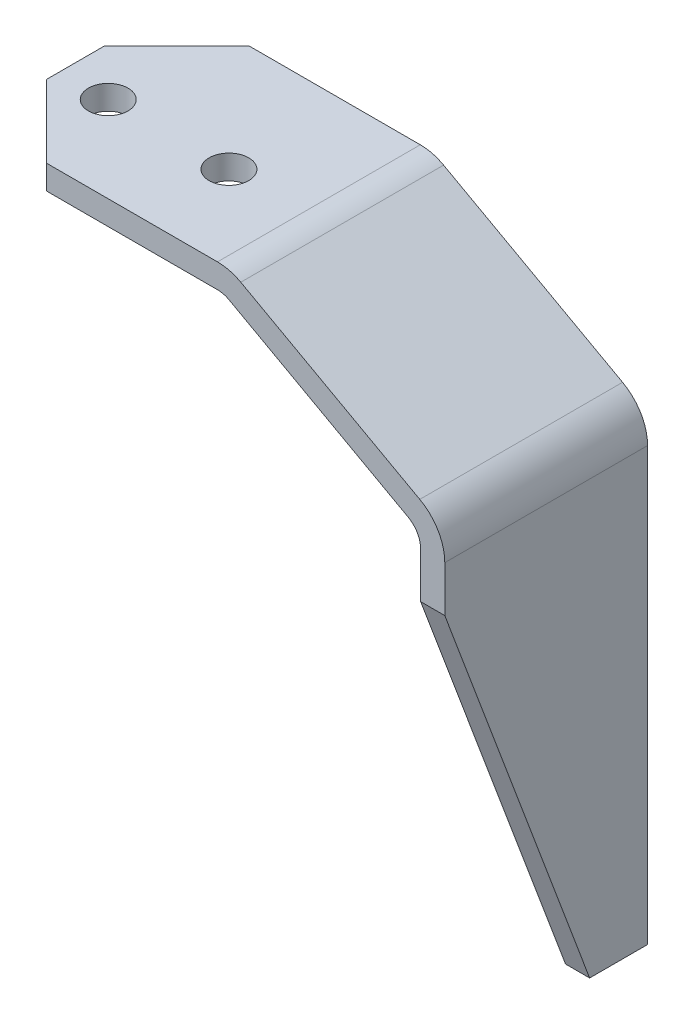
ISO-10303-21;
HEADER;
FILE_DESCRIPTION(('STEP AP214'),'2;1');
FILE_NAME('part.step','',(''),(''),'','','');
FILE_SCHEMA(('AUTOMOTIVE_DESIGN { 1 0 10303 214 1 1 1 1 }'));
ENDSEC;
DATA;
#1=APPLICATION_CONTEXT('core data for automotive mechanical design processes');
#2=APPLICATION_PROTOCOL_DEFINITION('international standard','automotive_design',2000,#1);
#3=PRODUCT_CONTEXT('',#1,'mechanical');
#4=PRODUCT('Part','Part','',(#3));
#5=PRODUCT_RELATED_PRODUCT_CATEGORY('part','',(#4));
#6=PRODUCT_DEFINITION_FORMATION('','',#4);
#7=PRODUCT_DEFINITION_CONTEXT('part definition',#1,'design');
#8=PRODUCT_DEFINITION('design','',#6,#7);
#9=PRODUCT_DEFINITION_SHAPE('','',#8);
#10=(LENGTH_UNIT() NAMED_UNIT(*) SI_UNIT(.MILLI.,.METRE.));
#11=(NAMED_UNIT(*) PLANE_ANGLE_UNIT() SI_UNIT($,.RADIAN.));
#12=(NAMED_UNIT(*) SI_UNIT($,.STERADIAN.) SOLID_ANGLE_UNIT());
#13=UNCERTAINTY_MEASURE_WITH_UNIT(LENGTH_MEASURE(1.E-05),#10,'distance_accuracy_value','');
#14=(GEOMETRIC_REPRESENTATION_CONTEXT(3) GLOBAL_UNCERTAINTY_ASSIGNED_CONTEXT((#13)) GLOBAL_UNIT_ASSIGNED_CONTEXT((#10,
#11,#12)) REPRESENTATION_CONTEXT('',''));
#15=CARTESIAN_POINT('',(0.,0.,0.));
#16=DIRECTION('',(0.,0.,1.));
#17=DIRECTION('',(1.,0.,0.));
#18=AXIS2_PLACEMENT_3D('',#15,#16,#17);
#19=CARTESIAN_POINT('',(-0.921587822254805,317.701582512491,-42.));
#20=DIRECTION('',(0.,0.,1.));
#21=DIRECTION('',(1.,0.,0.));
#22=AXIS2_PLACEMENT_3D('',#19,#20,#21);
#23=CYLINDRICAL_SURFACE('',#22,5.);
#24=CARTESIAN_POINT('',(-0.921587822254805,317.701582512491,0.));
#25=DIRECTION('',(0.,0.,-1.));
#26=DIRECTION('',(1.,0.,0.));
#27=AXIS2_PLACEMENT_3D('',#24,#25,#26);
#28=CIRCLE('',#27,5.);
#29=CARTESIAN_POINT('',(-0.921587822254821,322.701582512491,0.));
#30=VERTEX_POINT('',#29);
#31=CARTESIAN_POINT('',(1.48989491306705,322.081622582769,0.));
#32=VERTEX_POINT('',#31);
#33=EDGE_CURVE('E224',#30,#32,#28,.T.);
#34=ORIENTED_EDGE('',*,*,#33,.F.);
#35=DIRECTION('',(0.,0.,1.));
#36=VECTOR('',#35,1.);
#37=CARTESIAN_POINT('',(-0.921587822254821,322.701582512491,-42.));
#38=LINE('',#37,#36);
#39=CARTESIAN_POINT('',(-0.921587822254821,322.701582512491,-42.));
#40=VERTEX_POINT('',#39);
#41=EDGE_CURVE('E50',#40,#30,#38,.T.);
#42=ORIENTED_EDGE('',*,*,#41,.F.);
#43=CARTESIAN_POINT('',(-0.921587822254805,317.701582512491,-42.));
#44=DIRECTION('',(0.,0.,-1.));
#45=DIRECTION('',(1.,0.,0.));
#46=AXIS2_PLACEMENT_3D('',#43,#44,#45);
#47=CIRCLE('',#46,5.);
#48=CARTESIAN_POINT('',(1.48989491306705,322.081622582769,-42.));
#49=VERTEX_POINT('',#48);
#50=EDGE_CURVE('E260',#40,#49,#47,.T.);
#51=ORIENTED_EDGE('',*,*,#50,.T.);
#52=DIRECTION('',(0.,0.,1.));
#53=VECTOR('',#52,1.);
#54=CARTESIAN_POINT('',(1.48989491306705,322.081622582769,-42.));
#55=LINE('',#54,#53);
#56=EDGE_CURVE('E206',#49,#32,#55,.T.);
#57=ORIENTED_EDGE('',*,*,#56,.T.);
#58=EDGE_LOOP('',(#34,#42,#51,#57));
#59=FACE_BOUND('',#58,.T.);
#60=ADVANCED_FACE('F42',(#59),#23,.F.);
#61=CARTESIAN_POINT('',(-51.3507216881506,322.701582512491,-42.));
#62=DIRECTION('',(0.,-1.,0.));
#63=DIRECTION('',(0.,0.,-1.));
#64=AXIS2_PLACEMENT_3D('',#61,#62,#63);
#65=PLANE('',#64);
#66=DIRECTION('',(-0.707106781186547,0.,0.707106781186547));
#67=VECTOR('',#66,1.);
#68=CARTESIAN_POINT('',(-36.3507216881506,322.701582512491,-42.));
#69=LINE('',#68,#67);
#70=CARTESIAN_POINT('',(-36.3507216881506,322.701582512491,-42.));
#71=VERTEX_POINT('',#70);
#72=CARTESIAN_POINT('',(-51.3507216881506,322.701582512491,-27.));
#73=VERTEX_POINT('',#72);
#74=EDGE_CURVE('E150',#71,#73,#69,.T.);
#75=ORIENTED_EDGE('',*,*,#74,.F.);
#76=DIRECTION('',(1.,0.,0.));
#77=VECTOR('',#76,1.);
#78=CARTESIAN_POINT('',(-51.3507216881506,322.701582512491,-42.));
#79=LINE('',#78,#77);
#80=EDGE_CURVE('E208',#71,#40,#79,.T.);
#81=ORIENTED_EDGE('',*,*,#80,.T.);
#82=ORIENTED_EDGE('',*,*,#41,.T.);
#83=DIRECTION('',(1.,0.,0.));
#84=VECTOR('',#83,1.);
#85=CARTESIAN_POINT('',(-51.3507216881506,322.701582512491,0.));
#86=LINE('',#85,#84);
#87=CARTESIAN_POINT('',(-36.3507216881506,322.701582512491,0.));
#88=VERTEX_POINT('',#87);
#89=EDGE_CURVE('E259',#88,#30,#86,.T.);
#90=ORIENTED_EDGE('',*,*,#89,.F.);
#91=DIRECTION('',(0.707106781186547,0.,0.707106781186547));
#92=VECTOR('',#91,1.);
#93=CARTESIAN_POINT('',(-36.3507216881506,322.701582512491,0.));
#94=LINE('',#93,#92);
#95=CARTESIAN_POINT('',(-51.3507216881506,322.701582512491,-15.));
#96=VERTEX_POINT('',#95);
#97=EDGE_CURVE('E65',#96,#88,#94,.T.);
#98=ORIENTED_EDGE('',*,*,#97,.F.);
#99=DIRECTION('',(0.,0.,1.));
#100=VECTOR('',#99,1.);
#101=CARTESIAN_POINT('',(-51.3507216881506,322.701582512491,-42.));
#102=LINE('',#101,#100);
#103=EDGE_CURVE('E172',#73,#96,#102,.T.);
#104=ORIENTED_EDGE('',*,*,#103,.F.);
#105=EDGE_LOOP('',(#75,#81,#82,#90,#98,#104));
#106=FACE_BOUND('',#105,.T.);
#107=CARTESIAN_POINT('',(-16.3507216881506,322.701582512491,-17.8));
#108=DIRECTION('',(0.,-1.,0.));
#109=DIRECTION('',(0.,0.,-1.));
#110=AXIS2_PLACEMENT_3D('',#107,#108,#109);
#111=CIRCLE('',#110,4.1);
#112=CARTESIAN_POINT('',(-16.3507216881506,322.701582512491,-21.9));
#113=VERTEX_POINT('',#112);
#114=EDGE_CURVE('E272',#113,#113,#111,.T.);
#115=ORIENTED_EDGE('',*,*,#114,.F.);
#116=EDGE_LOOP('',(#115));
#117=FACE_BOUND('',#116,.T.);
#118=CARTESIAN_POINT('',(-41.3507216881506,322.701582512491,-17.8));
#119=DIRECTION('',(0.,-1.,0.));
#120=DIRECTION('',(0.,0.,-1.));
#121=AXIS2_PLACEMENT_3D('',#118,#119,#120);
#122=CIRCLE('',#121,4.1);
#123=CARTESIAN_POINT('',(-41.3507216881506,322.701582512491,-21.9));
#124=VERTEX_POINT('',#123);
#125=EDGE_CURVE('E287',#124,#124,#122,.T.);
#126=ORIENTED_EDGE('',*,*,#125,.F.);
#127=EDGE_LOOP('',(#126));
#128=FACE_BOUND('',#127,.T.);
#129=ADVANCED_FACE('F264',(#106,#117,#128),#65,.T.);
#130=CARTESIAN_POINT('',(-51.3507216881506,327.701582512491,-42.));
#131=DIRECTION('',(-1.,0.,0.));
#132=DIRECTION('',(0.,0.,1.));
#133=AXIS2_PLACEMENT_3D('',#130,#131,#132);
#134=PLANE('',#133);
#135=DIRECTION('',(0.,-1.,0.));
#136=VECTOR('',#135,1.);
#137=CARTESIAN_POINT('',(-51.3507216881506,327.701582512491,-27.));
#138=LINE('',#137,#136);
#139=CARTESIAN_POINT('',(-51.3507216881506,327.701582512491,-27.));
#140=VERTEX_POINT('',#139);
#141=EDGE_CURVE('E147',#140,#73,#138,.T.);
#142=ORIENTED_EDGE('',*,*,#141,.T.);
#143=ORIENTED_EDGE('',*,*,#103,.T.);
#144=DIRECTION('',(0.,-1.,0.));
#145=VECTOR('',#144,1.);
#146=CARTESIAN_POINT('',(-51.3507216881506,327.701582512491,-15.));
#147=LINE('',#146,#145);
#148=CARTESIAN_POINT('',(-51.3507216881506,327.701582512491,-15.));
#149=VERTEX_POINT('',#148);
#150=EDGE_CURVE('E170',#149,#96,#147,.T.);
#151=ORIENTED_EDGE('',*,*,#150,.F.);
#152=DIRECTION('',(0.,0.,1.));
#153=VECTOR('',#152,1.);
#154=CARTESIAN_POINT('',(-51.3507216881506,327.701582512491,-42.));
#155=LINE('',#154,#153);
#156=EDGE_CURVE('E162',#140,#149,#155,.T.);
#157=ORIENTED_EDGE('',*,*,#156,.F.);
#158=EDGE_LOOP('',(#142,#143,#151,#157));
#159=FACE_BOUND('',#158,.T.);
#160=ADVANCED_FACE('F169',(#159),#134,.T.);
#161=CARTESIAN_POINT('',(-51.3507216881506,327.701582512491,-42.));
#162=DIRECTION('',(0.,1.,0.));
#163=DIRECTION('',(0.,0.,1.));
#164=AXIS2_PLACEMENT_3D('',#161,#162,#163);
#165=PLANE('',#164);
#166=DIRECTION('',(-0.707106781186547,0.,0.707106781186547));
#167=VECTOR('',#166,1.);
#168=CARTESIAN_POINT('',(-36.3507216881506,327.701582512491,-42.));
#169=LINE('',#168,#167);
#170=CARTESIAN_POINT('',(-36.3507216881506,327.701582512491,-42.));
#171=VERTEX_POINT('',#170);
#172=EDGE_CURVE('E57',#171,#140,#169,.T.);
#173=ORIENTED_EDGE('',*,*,#172,.T.);
#174=ORIENTED_EDGE('',*,*,#156,.T.);
#175=DIRECTION('',(0.707106781186547,0.,0.707106781186547));
#176=VECTOR('',#175,1.);
#177=CARTESIAN_POINT('',(-36.3507216881506,327.701582512491,0.));
#178=LINE('',#177,#176);
#179=CARTESIAN_POINT('',(-36.3507216881506,327.701582512491,0.));
#180=VERTEX_POINT('',#179);
#181=EDGE_CURVE('E280',#149,#180,#178,.T.);
#182=ORIENTED_EDGE('',*,*,#181,.T.);
#183=DIRECTION('',(-1.,0.,0.));
#184=VECTOR('',#183,1.);
#185=CARTESIAN_POINT('',(-51.3507216881506,327.701582512491,0.));
#186=LINE('',#185,#184);
#187=CARTESIAN_POINT('',(-0.921587822254793,327.701582512491,0.));
#188=VERTEX_POINT('',#187);
#189=EDGE_CURVE('E255',#188,#180,#186,.T.);
#190=ORIENTED_EDGE('',*,*,#189,.F.);
#191=DIRECTION('',(0.,0.,1.));
#192=VECTOR('',#191,1.);
#193=CARTESIAN_POINT('',(-0.921587822254793,327.701582512491,-42.));
#194=LINE('',#193,#192);
#195=CARTESIAN_POINT('',(-0.921587822254793,327.701582512491,-42.));
#196=VERTEX_POINT('',#195);
#197=EDGE_CURVE('E173',#196,#188,#194,.T.);
#198=ORIENTED_EDGE('',*,*,#197,.F.);
#199=DIRECTION('',(-1.,0.,0.));
#200=VECTOR('',#199,1.);
#201=CARTESIAN_POINT('',(-51.3507216881506,327.701582512491,-42.));
#202=LINE('',#201,#200);
#203=EDGE_CURVE('E165',#196,#171,#202,.T.);
#204=ORIENTED_EDGE('',*,*,#203,.T.);
#205=EDGE_LOOP('',(#173,#174,#182,#190,#198,#204));
#206=FACE_BOUND('',#205,.T.);
#207=CARTESIAN_POINT('',(-16.3507216881506,327.701582512491,-17.8));
#208=DIRECTION('',(0.,-1.,0.));
#209=DIRECTION('',(0.,0.,-1.));
#210=AXIS2_PLACEMENT_3D('',#207,#208,#209);
#211=CIRCLE('',#210,4.1);
#212=CARTESIAN_POINT('',(-16.3507216881506,327.701582512491,-21.9));
#213=VERTEX_POINT('',#212);
#214=EDGE_CURVE('E278',#213,#213,#211,.T.);
#215=ORIENTED_EDGE('',*,*,#214,.T.);
#216=EDGE_LOOP('',(#215));
#217=FACE_BOUND('',#216,.T.);
#218=CARTESIAN_POINT('',(-41.3507216881506,327.701582512491,-17.8));
#219=DIRECTION('',(0.,-1.,0.));
#220=DIRECTION('',(0.,0.,-1.));
#221=AXIS2_PLACEMENT_3D('',#218,#219,#220);
#222=CIRCLE('',#221,4.1);
#223=CARTESIAN_POINT('',(-41.3507216881506,327.701582512491,-21.9));
#224=VERTEX_POINT('',#223);
#225=EDGE_CURVE('E289',#224,#224,#222,.T.);
#226=ORIENTED_EDGE('',*,*,#225,.T.);
#227=EDGE_LOOP('',(#226));
#228=FACE_BOUND('',#227,.T.);
#229=ADVANCED_FACE('F159',(#206,#217,#228),#165,.T.);
#230=CARTESIAN_POINT('',(-0.921587822254805,317.701582512491,-42.));
#231=DIRECTION('',(0.,0.,1.));
#232=DIRECTION('',(1.,0.,0.));
#233=AXIS2_PLACEMENT_3D('',#230,#231,#232);
#234=CYLINDRICAL_SURFACE('',#233,9.99999999999996);
#235=CARTESIAN_POINT('',(-0.921587822254805,317.701582512491,0.));
#236=DIRECTION('',(0.,0.,1.));
#237=DIRECTION('',(1.,0.,0.));
#238=AXIS2_PLACEMENT_3D('',#235,#236,#237);
#239=CIRCLE('',#238,9.99999999999996);
#240=CARTESIAN_POINT('',(3.90137764838883,326.461662653048,0.));
#241=VERTEX_POINT('',#240);
#242=EDGE_CURVE('E251',#241,#188,#239,.T.);
#243=ORIENTED_EDGE('',*,*,#242,.F.);
#244=DIRECTION('',(0.,0.,1.));
#245=VECTOR('',#244,1.);
#246=CARTESIAN_POINT('',(3.90137764838883,326.461662653048,-42.));
#247=LINE('',#246,#245);
#248=CARTESIAN_POINT('',(3.90137764838883,326.461662653048,-42.));
#249=VERTEX_POINT('',#248);
#250=EDGE_CURVE('E180',#249,#241,#247,.T.);
#251=ORIENTED_EDGE('',*,*,#250,.F.);
#252=CARTESIAN_POINT('',(-0.921587822254805,317.701582512491,-42.));
#253=DIRECTION('',(0.,0.,1.));
#254=DIRECTION('',(1.,0.,0.));
#255=AXIS2_PLACEMENT_3D('',#252,#253,#254);
#256=CIRCLE('',#255,9.99999999999996);
#257=EDGE_CURVE('E220',#249,#196,#256,.T.);
#258=ORIENTED_EDGE('',*,*,#257,.T.);
#259=ORIENTED_EDGE('',*,*,#197,.T.);
#260=EDGE_LOOP('',(#243,#251,#258,#259));
#261=FACE_BOUND('',#260,.T.);
#262=ADVANCED_FACE('F337',(#261),#234,.T.);
#263=CARTESIAN_POINT('',(3.90137764838883,326.461662653048,-42.));
#264=DIRECTION('',(0.482296547064366,0.876008014055688,0.));
#265=DIRECTION('',(-0.876008014055688,0.482296547064366,0.));
#266=AXIS2_PLACEMENT_3D('',#263,#264,#265);
#267=PLANE('',#266);
#268=DIRECTION('',(-0.876008014055688,0.482296547064366,0.));
#269=VECTOR('',#268,1.);
#270=CARTESIAN_POINT('',(3.90137764838883,326.461662653048,0.));
#271=LINE('',#270,#269);
#272=CARTESIAN_POINT('',(40.972243782493,306.051859950002,0.));
#273=VERTEX_POINT('',#272);
#274=EDGE_CURVE('E248',#273,#241,#271,.T.);
#275=ORIENTED_EDGE('',*,*,#274,.F.);
#276=DIRECTION('',(0.,0.,1.));
#277=VECTOR('',#276,1.);
#278=CARTESIAN_POINT('',(40.972243782493,306.051859950002,-42.));
#279=LINE('',#278,#277);
#280=CARTESIAN_POINT('',(40.972243782493,306.051859950002,-42.));
#281=VERTEX_POINT('',#280);
#282=EDGE_CURVE('E186',#281,#273,#279,.T.);
#283=ORIENTED_EDGE('',*,*,#282,.F.);
#284=DIRECTION('',(-0.876008014055688,0.482296547064366,0.));
#285=VECTOR('',#284,1.);
#286=CARTESIAN_POINT('',(3.90137764838883,326.461662653048,-42.));
#287=LINE('',#286,#285);
#288=EDGE_CURVE('E330',#281,#249,#287,.T.);
#289=ORIENTED_EDGE('',*,*,#288,.T.);
#290=ORIENTED_EDGE('',*,*,#250,.T.);
#291=EDGE_LOOP('',(#275,#283,#289,#290));
#292=FACE_BOUND('',#291,.T.);
#293=ADVANCED_FACE('F344',(#292),#267,.T.);
#294=CARTESIAN_POINT('',(36.1492783118493,297.291779809445,-42.));
#295=DIRECTION('',(0.,0.,1.));
#296=DIRECTION('',(1.,0.,0.));
#297=AXIS2_PLACEMENT_3D('',#294,#295,#296);
#298=CYLINDRICAL_SURFACE('',#297,10.);
#299=CARTESIAN_POINT('',(36.1492783118493,297.291779809445,0.));
#300=DIRECTION('',(0.,0.,1.));
#301=DIRECTION('',(1.,0.,0.));
#302=AXIS2_PLACEMENT_3D('',#299,#300,#301);
#303=CIRCLE('',#302,10.);
#304=CARTESIAN_POINT('',(46.1492783118493,297.291779809445,0.));
#305=VERTEX_POINT('',#304);
#306=EDGE_CURVE('E244',#305,#273,#303,.T.);
#307=ORIENTED_EDGE('',*,*,#306,.F.);
#308=DIRECTION('',(0.,0.,1.));
#309=VECTOR('',#308,1.);
#310=CARTESIAN_POINT('',(46.1492783118493,297.291779809445,-42.));
#311=LINE('',#310,#309);
#312=CARTESIAN_POINT('',(46.1492783118493,297.291779809445,-42.));
#313=VERTEX_POINT('',#312);
#314=EDGE_CURVE('E189',#313,#305,#311,.T.);
#315=ORIENTED_EDGE('',*,*,#314,.F.);
#316=CARTESIAN_POINT('',(36.1492783118493,297.291779809445,-42.));
#317=DIRECTION('',(0.,0.,1.));
#318=DIRECTION('',(1.,0.,0.));
#319=AXIS2_PLACEMENT_3D('',#316,#317,#318);
#320=CIRCLE('',#319,10.);
#321=EDGE_CURVE('E326',#313,#281,#320,.T.);
#322=ORIENTED_EDGE('',*,*,#321,.T.);
#323=ORIENTED_EDGE('',*,*,#282,.T.);
#324=EDGE_LOOP('',(#307,#315,#322,#323));
#325=FACE_BOUND('',#324,.T.);
#326=ADVANCED_FACE('F347',(#325),#298,.T.);
#327=CARTESIAN_POINT('',(46.1492783118493,297.291779809445,-42.));
#328=DIRECTION('',(1.,0.,0.));
#329=DIRECTION('',(0.,1.,0.));
#330=AXIS2_PLACEMENT_3D('',#327,#328,#329);
#331=PLANE('',#330);
#332=DIRECTION('',(0.,0.936329177569045,0.351123441588391));
#333=VECTOR('',#332,1.);
#334=CARTESIAN_POINT('',(46.1492783118493,282.313344258767,-2.0575051981926));
#335=LINE('',#334,#333);
#336=CARTESIAN_POINT('',(46.1492783118493,207.800024787281,-30.));
#337=VERTEX_POINT('',#336);
#338=CARTESIAN_POINT('',(46.1492783118493,287.800024787281,0.));
#339=VERTEX_POINT('',#338);
#340=EDGE_CURVE('E229',#337,#339,#335,.T.);
#341=ORIENTED_EDGE('',*,*,#340,.F.);
#342=DIRECTION('',(0.,0.,1.));
#343=VECTOR('',#342,1.);
#344=CARTESIAN_POINT('',(46.1492783118493,207.800024787281,-42.));
#345=LINE('',#344,#343);
#346=CARTESIAN_POINT('',(46.1492783118493,207.800024787281,-42.));
#347=VERTEX_POINT('',#346);
#348=EDGE_CURVE('E193',#347,#337,#345,.T.);
#349=ORIENTED_EDGE('',*,*,#348,.F.);
#350=DIRECTION('',(0.,1.,0.));
#351=VECTOR('',#350,1.);
#352=CARTESIAN_POINT('',(46.1492783118493,297.291779809445,-42.));
#353=LINE('',#352,#351);
#354=EDGE_CURVE('E322',#347,#313,#353,.T.);
#355=ORIENTED_EDGE('',*,*,#354,.T.);
#356=ORIENTED_EDGE('',*,*,#314,.T.);
#357=DIRECTION('',(0.,1.,0.));
#358=VECTOR('',#357,1.);
#359=CARTESIAN_POINT('',(46.1492783118493,297.291779809445,0.));
#360=LINE('',#359,#358);
#361=EDGE_CURVE('E241',#339,#305,#360,.T.);
#362=ORIENTED_EDGE('',*,*,#361,.F.);
#363=EDGE_LOOP('',(#341,#349,#355,#356,#362));
#364=FACE_BOUND('',#363,.T.);
#365=ADVANCED_FACE('F352',(#364),#331,.T.);
#366=CARTESIAN_POINT('',(41.1492783118493,207.800024787281,-42.));
#367=DIRECTION('',(0.,-1.,0.));
#368=DIRECTION('',(1.,0.,0.));
#369=AXIS2_PLACEMENT_3D('',#366,#367,#368);
#370=PLANE('',#369);
#371=DIRECTION('',(-1.,0.,0.));
#372=VECTOR('',#371,1.);
#373=CARTESIAN_POINT('',(159.400764761462,207.800024787281,-30.));
#374=LINE('',#373,#372);
#375=CARTESIAN_POINT('',(41.1492783118493,207.800024787281,-30.));
#376=VERTEX_POINT('',#375);
#377=EDGE_CURVE('E298',#337,#376,#374,.T.);
#378=ORIENTED_EDGE('',*,*,#377,.T.);
#379=DIRECTION('',(0.,0.,1.));
#380=VECTOR('',#379,1.);
#381=CARTESIAN_POINT('',(41.1492783118493,207.800024787281,-42.));
#382=LINE('',#381,#380);
#383=CARTESIAN_POINT('',(41.1492783118493,207.800024787281,-42.));
#384=VERTEX_POINT('',#383);
#385=EDGE_CURVE('E197',#384,#376,#382,.T.);
#386=ORIENTED_EDGE('',*,*,#385,.F.);
#387=DIRECTION('',(1.,0.,0.));
#388=VECTOR('',#387,1.);
#389=CARTESIAN_POINT('',(41.1492783118493,207.800024787281,-42.));
#390=LINE('',#389,#388);
#391=EDGE_CURVE('E318',#384,#347,#390,.T.);
#392=ORIENTED_EDGE('',*,*,#391,.T.);
#393=ORIENTED_EDGE('',*,*,#348,.T.);
#394=EDGE_LOOP('',(#378,#386,#392,#393));
#395=FACE_BOUND('',#394,.T.);
#396=ADVANCED_FACE('F355',(#395),#370,.T.);
#397=CARTESIAN_POINT('',(41.1492783118493,297.291779809445,-42.));
#398=DIRECTION('',(-1.,0.,0.));
#399=DIRECTION('',(0.,0.,1.));
#400=AXIS2_PLACEMENT_3D('',#397,#398,#399);
#401=PLANE('',#400);
#402=DIRECTION('',(0.,-0.936329177569045,-0.351123441588391));
#403=VECTOR('',#402,1.);
#404=CARTESIAN_POINT('',(41.1492783118493,207.800024787281,-30.));
#405=LINE('',#404,#403);
#406=CARTESIAN_POINT('',(41.1492783118493,287.800024787281,0.));
#407=VERTEX_POINT('',#406);
#408=EDGE_CURVE('E293',#407,#376,#405,.T.);
#409=ORIENTED_EDGE('',*,*,#408,.F.);
#410=DIRECTION('',(0.,-1.,0.));
#411=VECTOR('',#410,1.);
#412=CARTESIAN_POINT('',(41.1492783118493,297.291779809445,0.));
#413=LINE('',#412,#411);
#414=CARTESIAN_POINT('',(41.1492783118494,297.291779809445,0.));
#415=VERTEX_POINT('',#414);
#416=EDGE_CURVE('E237',#415,#407,#413,.T.);
#417=ORIENTED_EDGE('',*,*,#416,.F.);
#418=DIRECTION('',(0.,0.,1.));
#419=VECTOR('',#418,1.);
#420=CARTESIAN_POINT('',(41.1492783118494,297.291779809445,-42.));
#421=LINE('',#420,#419);
#422=CARTESIAN_POINT('',(41.1492783118494,297.291779809445,-42.));
#423=VERTEX_POINT('',#422);
#424=EDGE_CURVE('E201',#423,#415,#421,.T.);
#425=ORIENTED_EDGE('',*,*,#424,.F.);
#426=DIRECTION('',(0.,-1.,0.));
#427=VECTOR('',#426,1.);
#428=CARTESIAN_POINT('',(41.1492783118493,297.291779809445,-42.));
#429=LINE('',#428,#427);
#430=EDGE_CURVE('E314',#423,#384,#429,.T.);
#431=ORIENTED_EDGE('',*,*,#430,.T.);
#432=ORIENTED_EDGE('',*,*,#385,.T.);
#433=EDGE_LOOP('',(#409,#417,#425,#431,#432));
#434=FACE_BOUND('',#433,.T.);
#435=ADVANCED_FACE('F360',(#434),#401,.T.);
#436=CARTESIAN_POINT('',(36.1492783118493,297.291779809445,-42.));
#437=DIRECTION('',(0.,0.,1.));
#438=DIRECTION('',(1.,0.,0.));
#439=AXIS2_PLACEMENT_3D('',#436,#437,#438);
#440=CYLINDRICAL_SURFACE('',#439,5.00000000000001);
#441=CARTESIAN_POINT('',(36.1492783118493,297.291779809445,0.));
#442=DIRECTION('',(0.,0.,-1.));
#443=DIRECTION('',(1.,0.,0.));
#444=AXIS2_PLACEMENT_3D('',#441,#442,#443);
#445=CIRCLE('',#444,5.00000000000001);
#446=CARTESIAN_POINT('',(38.5607610471712,301.671819879723,0.));
#447=VERTEX_POINT('',#446);
#448=EDGE_CURVE('E233',#447,#415,#445,.T.);
#449=ORIENTED_EDGE('',*,*,#448,.F.);
#450=DIRECTION('',(0.,0.,1.));
#451=VECTOR('',#450,1.);
#452=CARTESIAN_POINT('',(38.5607610471712,301.671819879723,-42.));
#453=LINE('',#452,#451);
#454=CARTESIAN_POINT('',(38.5607610471712,301.671819879723,-42.));
#455=VERTEX_POINT('',#454);
#456=EDGE_CURVE('E204',#455,#447,#453,.T.);
#457=ORIENTED_EDGE('',*,*,#456,.F.);
#458=CARTESIAN_POINT('',(36.1492783118493,297.291779809445,-42.));
#459=DIRECTION('',(0.,0.,-1.));
#460=DIRECTION('',(1.,0.,0.));
#461=AXIS2_PLACEMENT_3D('',#458,#459,#460);
#462=CIRCLE('',#461,5.00000000000001);
#463=EDGE_CURVE('E310',#455,#423,#462,.T.);
#464=ORIENTED_EDGE('',*,*,#463,.T.);
#465=ORIENTED_EDGE('',*,*,#424,.T.);
#466=EDGE_LOOP('',(#449,#457,#464,#465));
#467=FACE_BOUND('',#466,.T.);
#468=ADVANCED_FACE('F364',(#467),#440,.F.);
#469=CARTESIAN_POINT('',(1.48989491306705,322.081622582769,-42.));
#470=DIRECTION('',(-0.482296547064368,-0.876008014055687,0.));
#471=DIRECTION('',(0.876008014055687,-0.482296547064368,0.));
#472=AXIS2_PLACEMENT_3D('',#469,#470,#471);
#473=PLANE('',#472);
#474=DIRECTION('',(0.876008014055687,-0.482296547064367,0.));
#475=VECTOR('',#474,1.);
#476=CARTESIAN_POINT('',(1.48989491306705,322.081622582769,0.));
#477=LINE('',#476,#475);
#478=EDGE_CURVE('E228',#32,#447,#477,.T.);
#479=ORIENTED_EDGE('',*,*,#478,.F.);
#480=ORIENTED_EDGE('',*,*,#56,.F.);
#481=DIRECTION('',(0.876008014055687,-0.482296547064367,0.));
#482=VECTOR('',#481,1.);
#483=CARTESIAN_POINT('',(1.48989491306705,322.081622582769,-42.));
#484=LINE('',#483,#482);
#485=EDGE_CURVE('E306',#49,#455,#484,.T.);
#486=ORIENTED_EDGE('',*,*,#485,.T.);
#487=ORIENTED_EDGE('',*,*,#456,.T.);
#488=EDGE_LOOP('',(#479,#480,#486,#487));
#489=FACE_BOUND('',#488,.T.);
#490=ADVANCED_FACE('F367',(#489),#473,.T.);
#491=CARTESIAN_POINT('',(-0.921587822254805,317.701582512491,-42.));
#492=DIRECTION('',(0.,0.,1.));
#493=DIRECTION('',(1.,0.,0.));
#494=AXIS2_PLACEMENT_3D('',#491,#492,#493);
#495=PLANE('',#494);
#496=ORIENTED_EDGE('',*,*,#80,.F.);
#497=DIRECTION('',(0.,-1.,0.));
#498=VECTOR('',#497,1.);
#499=CARTESIAN_POINT('',(-36.3507216881506,327.701582512491,-42.));
#500=LINE('',#499,#498);
#501=EDGE_CURVE('E155',#171,#71,#500,.T.);
#502=ORIENTED_EDGE('',*,*,#501,.F.);
#503=ORIENTED_EDGE('',*,*,#203,.F.);
#504=ORIENTED_EDGE('',*,*,#257,.F.);
#505=ORIENTED_EDGE('',*,*,#288,.F.);
#506=ORIENTED_EDGE('',*,*,#321,.F.);
#507=ORIENTED_EDGE('',*,*,#354,.F.);
#508=ORIENTED_EDGE('',*,*,#391,.F.);
#509=ORIENTED_EDGE('',*,*,#430,.F.);
#510=ORIENTED_EDGE('',*,*,#463,.F.);
#511=ORIENTED_EDGE('',*,*,#485,.F.);
#512=ORIENTED_EDGE('',*,*,#50,.F.);
#513=EDGE_LOOP('',(#496,#502,#503,#504,#505,#506,#507,#508,#509,#510,#511,#512));
#514=FACE_BOUND('',#513,.T.);
#515=ADVANCED_FACE('F340',(#514),#495,.F.);
#516=CARTESIAN_POINT('',(-0.921587822254805,317.701582512491,0.));
#517=DIRECTION('',(0.,0.,1.));
#518=DIRECTION('',(1.,0.,0.));
#519=AXIS2_PLACEMENT_3D('',#516,#517,#518);
#520=PLANE('',#519);
#521=DIRECTION('',(0.,-1.,0.));
#522=VECTOR('',#521,1.);
#523=CARTESIAN_POINT('',(-36.3507216881506,327.701582512491,0.));
#524=LINE('',#523,#522);
#525=EDGE_CURVE('E269',#180,#88,#524,.T.);
#526=ORIENTED_EDGE('',*,*,#525,.T.);
#527=ORIENTED_EDGE('',*,*,#89,.T.);
#528=ORIENTED_EDGE('',*,*,#33,.T.);
#529=ORIENTED_EDGE('',*,*,#478,.T.);
#530=ORIENTED_EDGE('',*,*,#448,.T.);
#531=ORIENTED_EDGE('',*,*,#416,.T.);
#532=DIRECTION('',(-1.,0.,0.));
#533=VECTOR('',#532,1.);
#534=CARTESIAN_POINT('',(-0.921587822254805,287.800024787281,0.));
#535=LINE('',#534,#533);
#536=EDGE_CURVE('E11',#339,#407,#535,.T.);
#537=ORIENTED_EDGE('',*,*,#536,.F.);
#538=ORIENTED_EDGE('',*,*,#361,.T.);
#539=ORIENTED_EDGE('',*,*,#306,.T.);
#540=ORIENTED_EDGE('',*,*,#274,.T.);
#541=ORIENTED_EDGE('',*,*,#242,.T.);
#542=ORIENTED_EDGE('',*,*,#189,.T.);
#543=EDGE_LOOP('',(#526,#527,#528,#529,#530,#531,#537,#538,#539,#540,#541,#542));
#544=FACE_BOUND('',#543,.T.);
#545=ADVANCED_FACE('F268',(#544),#520,.T.);
#546=CARTESIAN_POINT('',(159.400764761462,207.800024787281,-30.));
#547=DIRECTION('',(0.,0.351123441588391,-0.936329177569045));
#548=DIRECTION('',(0.,0.936329177569045,0.351123441588392));
#549=AXIS2_PLACEMENT_3D('',#546,#547,#548);
#550=PLANE('',#549);
#551=ORIENTED_EDGE('',*,*,#340,.T.);
#552=ORIENTED_EDGE('',*,*,#536,.T.);
#553=ORIENTED_EDGE('',*,*,#408,.T.);
#554=ORIENTED_EDGE('',*,*,#377,.F.);
#555=EDGE_LOOP('',(#551,#552,#553,#554));
#556=FACE_BOUND('',#555,.T.);
#557=ADVANCED_FACE('F424',(#556),#550,.F.);
#558=CARTESIAN_POINT('',(-41.3507216881506,327.701582512491,-17.8));
#559=DIRECTION('',(0.,-1.,0.));
#560=DIRECTION('',(0.,0.,-1.));
#561=AXIS2_PLACEMENT_3D('',#558,#559,#560);
#562=CYLINDRICAL_SURFACE('',#561,4.1);
#563=ORIENTED_EDGE('',*,*,#225,.F.);
#564=EDGE_LOOP('',(#563));
#565=FACE_BOUND('',#564,.T.);
#566=ORIENTED_EDGE('',*,*,#125,.T.);
#567=EDGE_LOOP('',(#566));
#568=FACE_BOUND('',#567,.T.);
#569=ADVANCED_FACE('F432',(#565,#568),#562,.F.);
#570=CARTESIAN_POINT('',(-16.3507216881506,327.701582512491,-17.8));
#571=DIRECTION('',(0.,-1.,0.));
#572=DIRECTION('',(0.,0.,-1.));
#573=AXIS2_PLACEMENT_3D('',#570,#571,#572);
#574=CYLINDRICAL_SURFACE('',#573,4.1);
#575=ORIENTED_EDGE('',*,*,#214,.F.);
#576=EDGE_LOOP('',(#575));
#577=FACE_BOUND('',#576,.T.);
#578=ORIENTED_EDGE('',*,*,#114,.T.);
#579=EDGE_LOOP('',(#578));
#580=FACE_BOUND('',#579,.T.);
#581=ADVANCED_FACE('F441',(#577,#580),#574,.F.);
#582=CARTESIAN_POINT('',(-36.3507216881506,327.701582512491,0.));
#583=DIRECTION('',(0.707106781186547,0.,-0.707106781186547));
#584=DIRECTION('',(-0.707106781186548,0.,-0.707106781186548));
#585=AXIS2_PLACEMENT_3D('',#582,#583,#584);
#586=PLANE('',#585);
#587=ORIENTED_EDGE('',*,*,#97,.T.);
#588=ORIENTED_EDGE('',*,*,#525,.F.);
#589=ORIENTED_EDGE('',*,*,#181,.F.);
#590=ORIENTED_EDGE('',*,*,#150,.T.);
#591=EDGE_LOOP('',(#587,#588,#589,#590));
#592=FACE_BOUND('',#591,.T.);
#593=ADVANCED_FACE('F450',(#592),#586,.F.);
#594=CARTESIAN_POINT('',(-36.3507216881506,327.701582512491,-42.));
#595=DIRECTION('',(0.707106781186547,0.,0.707106781186547));
#596=DIRECTION('',(0.707106781186548,0.,-0.707106781186548));
#597=AXIS2_PLACEMENT_3D('',#594,#595,#596);
#598=PLANE('',#597);
#599=ORIENTED_EDGE('',*,*,#74,.T.);
#600=ORIENTED_EDGE('',*,*,#141,.F.);
#601=ORIENTED_EDGE('',*,*,#172,.F.);
#602=ORIENTED_EDGE('',*,*,#501,.T.);
#603=EDGE_LOOP('',(#599,#600,#601,#602));
#604=FACE_BOUND('',#603,.T.);
#605=ADVANCED_FACE('F148',(#604),#598,.F.);
#606=CLOSED_SHELL('',(#60,#129,#160,#229,#262,#293,#326,#365,#396,#435,#468,#490,#515,#545,#557,
#569,#581,#593,#605));
#607=MANIFOLD_SOLID_BREP('B2',#606);
#608=ADVANCED_BREP_SHAPE_REPRESENTATION('',(#18,#607),#14);
#609=SHAPE_DEFINITION_REPRESENTATION(#9,#608);
ENDSEC;
END-ISO-10303-21;
